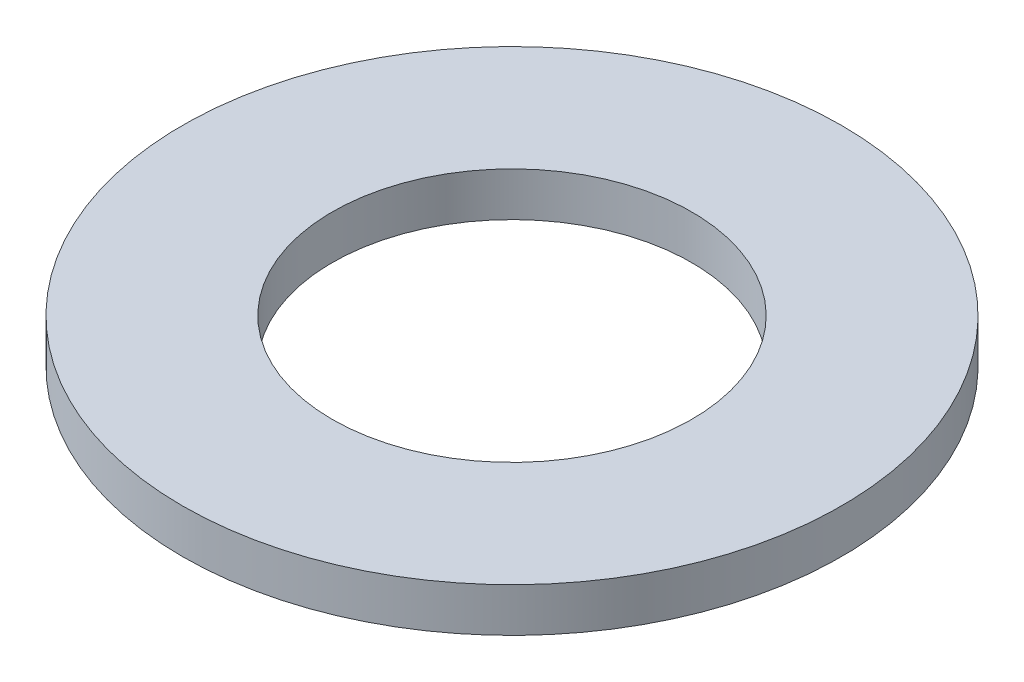
ISO-10303-21;
HEADER;
FILE_DESCRIPTION(('STEP AP214'),'2;1');
FILE_NAME('part.step','',(''),(''),'','','');
FILE_SCHEMA(('AUTOMOTIVE_DESIGN { 1 0 10303 214 1 1 1 1 }'));
ENDSEC;
DATA;
#1=APPLICATION_CONTEXT('core data for automotive mechanical design processes');
#2=APPLICATION_PROTOCOL_DEFINITION('international standard','automotive_design',2000,#1);
#3=PRODUCT_CONTEXT('',#1,'mechanical');
#4=PRODUCT('Part','Part','',(#3));
#5=PRODUCT_RELATED_PRODUCT_CATEGORY('part','',(#4));
#6=PRODUCT_DEFINITION_FORMATION('','',#4);
#7=PRODUCT_DEFINITION_CONTEXT('part definition',#1,'design');
#8=PRODUCT_DEFINITION('design','',#6,#7);
#9=PRODUCT_DEFINITION_SHAPE('','',#8);
#10=(LENGTH_UNIT() NAMED_UNIT(*) SI_UNIT(.MILLI.,.METRE.));
#11=(NAMED_UNIT(*) PLANE_ANGLE_UNIT() SI_UNIT($,.RADIAN.));
#12=(NAMED_UNIT(*) SI_UNIT($,.STERADIAN.) SOLID_ANGLE_UNIT());
#13=UNCERTAINTY_MEASURE_WITH_UNIT(LENGTH_MEASURE(1.E-05),#10,'distance_accuracy_value','');
#14=(GEOMETRIC_REPRESENTATION_CONTEXT(3) GLOBAL_UNCERTAINTY_ASSIGNED_CONTEXT((#13)) GLOBAL_UNIT_ASSIGNED_CONTEXT((#10,
#11,#12)) REPRESENTATION_CONTEXT('',''));
#15=CARTESIAN_POINT('',(0.,0.,0.));
#16=DIRECTION('',(0.,0.,1.));
#17=DIRECTION('',(1.,0.,0.));
#18=AXIS2_PLACEMENT_3D('',#15,#16,#17);
#19=CARTESIAN_POINT('',(0.,11.,0.));
#20=DIRECTION('',(0.,-1.,0.));
#21=DIRECTION('',(0.,0.,-1.));
#22=AXIS2_PLACEMENT_3D('',#19,#20,#21);
#23=CYLINDRICAL_SURFACE('',#22,82.5);
#24=CARTESIAN_POINT('',(0.,11.,0.));
#25=DIRECTION('',(0.,1.,0.));
#26=DIRECTION('',(0.,0.,1.));
#27=AXIS2_PLACEMENT_3D('',#24,#25,#26);
#28=CIRCLE('',#27,82.5);
#29=CARTESIAN_POINT('',(0.,11.,82.5));
#30=VERTEX_POINT('',#29);
#31=EDGE_CURVE('E10',#30,#30,#28,.T.);
#32=ORIENTED_EDGE('',*,*,#31,.F.);
#33=EDGE_LOOP('',(#32));
#34=FACE_BOUND('',#33,.T.);
#35=CARTESIAN_POINT('',(0.,0.,0.));
#36=DIRECTION('',(0.,1.,0.));
#37=DIRECTION('',(0.,0.,1.));
#38=AXIS2_PLACEMENT_3D('',#35,#36,#37);
#39=CIRCLE('',#38,82.5);
#40=CARTESIAN_POINT('',(0.,0.,82.5));
#41=VERTEX_POINT('',#40);
#42=EDGE_CURVE('E37',#41,#41,#39,.T.);
#43=ORIENTED_EDGE('',*,*,#42,.T.);
#44=EDGE_LOOP('',(#43));
#45=FACE_BOUND('',#44,.T.);
#46=ADVANCED_FACE('F40',(#34,#45),#23,.T.);
#47=CARTESIAN_POINT('',(0.,11.,0.));
#48=DIRECTION('',(0.,1.,0.));
#49=DIRECTION('',(0.,0.,1.));
#50=AXIS2_PLACEMENT_3D('',#47,#48,#49);
#51=PLANE('',#50);
#52=CARTESIAN_POINT('',(0.,11.,0.));
#53=DIRECTION('',(0.,1.,0.));
#54=DIRECTION('',(0.,0.,1.));
#55=AXIS2_PLACEMENT_3D('',#52,#53,#54);
#56=CIRCLE('',#55,45.);
#57=CARTESIAN_POINT('',(0.,11.,45.));
#58=VERTEX_POINT('',#57);
#59=EDGE_CURVE('E50',#58,#58,#56,.T.);
#60=ORIENTED_EDGE('',*,*,#59,.F.);
#61=EDGE_LOOP('',(#60));
#62=FACE_BOUND('',#61,.T.);
#63=ORIENTED_EDGE('',*,*,#31,.T.);
#64=EDGE_LOOP('',(#63));
#65=FACE_BOUND('',#64,.T.);
#66=ADVANCED_FACE('F59',(#62,#65),#51,.T.);
#67=CARTESIAN_POINT('',(0.,0.,0.));
#68=DIRECTION('',(0.,1.,0.));
#69=DIRECTION('',(0.,0.,1.));
#70=AXIS2_PLACEMENT_3D('',#67,#68,#69);
#71=PLANE('',#70);
#72=CARTESIAN_POINT('',(0.,0.,0.));
#73=DIRECTION('',(0.,1.,0.));
#74=DIRECTION('',(0.,0.,1.));
#75=AXIS2_PLACEMENT_3D('',#72,#73,#74);
#76=CIRCLE('',#75,45.);
#77=CARTESIAN_POINT('',(0.,0.,45.));
#78=VERTEX_POINT('',#77);
#79=EDGE_CURVE('E47',#78,#78,#76,.T.);
#80=ORIENTED_EDGE('',*,*,#79,.T.);
#81=EDGE_LOOP('',(#80));
#82=FACE_BOUND('',#81,.T.);
#83=ORIENTED_EDGE('',*,*,#42,.F.);
#84=EDGE_LOOP('',(#83));
#85=FACE_BOUND('',#84,.T.);
#86=ADVANCED_FACE('F58',(#82,#85),#71,.F.);
#87=CARTESIAN_POINT('',(0.,11.,0.));
#88=DIRECTION('',(0.,-1.,0.));
#89=DIRECTION('',(0.,0.,-1.));
#90=AXIS2_PLACEMENT_3D('',#87,#88,#89);
#91=CYLINDRICAL_SURFACE('',#90,45.);
#92=ORIENTED_EDGE('',*,*,#59,.T.);
#93=EDGE_LOOP('',(#92));
#94=FACE_BOUND('',#93,.T.);
#95=ORIENTED_EDGE('',*,*,#79,.F.);
#96=EDGE_LOOP('',(#95));
#97=FACE_BOUND('',#96,.T.);
#98=ADVANCED_FACE('F54',(#94,#97),#91,.F.);
#99=CLOSED_SHELL('',(#46,#66,#86,#98));
#100=MANIFOLD_SOLID_BREP('B2',#99);
#101=ADVANCED_BREP_SHAPE_REPRESENTATION('',(#18,#100),#14);
#102=SHAPE_DEFINITION_REPRESENTATION(#9,#101);
ENDSEC;
END-ISO-10303-21;
